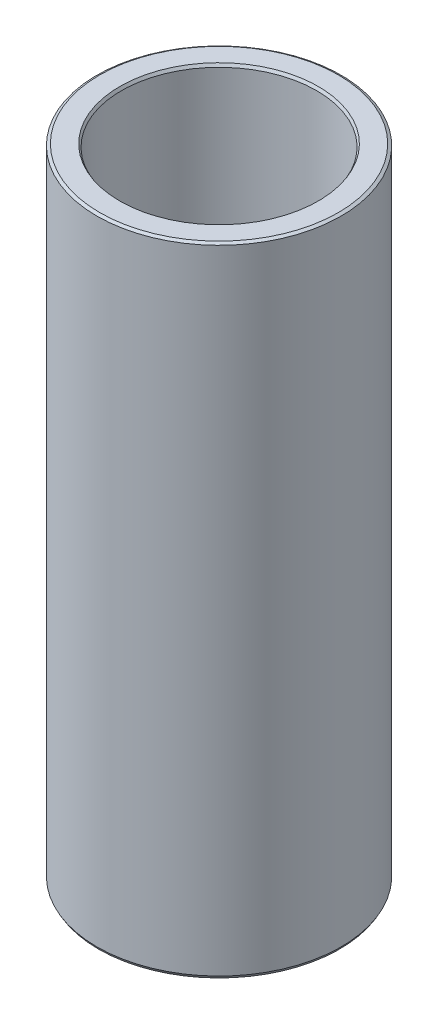
ISO-10303-21;
HEADER;
FILE_DESCRIPTION(('STEP AP214'),'2;1');
FILE_NAME('part.step','',(''),(''),'','','');
FILE_SCHEMA(('AUTOMOTIVE_DESIGN { 1 0 10303 214 1 1 1 1 }'));
ENDSEC;
DATA;
#1=APPLICATION_CONTEXT('core data for automotive mechanical design processes');
#2=APPLICATION_PROTOCOL_DEFINITION('international standard','automotive_design',2000,#1);
#3=PRODUCT_CONTEXT('',#1,'mechanical');
#4=PRODUCT('Part','Part','',(#3));
#5=PRODUCT_RELATED_PRODUCT_CATEGORY('part','',(#4));
#6=PRODUCT_DEFINITION_FORMATION('','',#4);
#7=PRODUCT_DEFINITION_CONTEXT('part definition',#1,'design');
#8=PRODUCT_DEFINITION('design','',#6,#7);
#9=PRODUCT_DEFINITION_SHAPE('','',#8);
#10=(LENGTH_UNIT() NAMED_UNIT(*) SI_UNIT(.MILLI.,.METRE.));
#11=(NAMED_UNIT(*) PLANE_ANGLE_UNIT() SI_UNIT($,.RADIAN.));
#12=(NAMED_UNIT(*) SI_UNIT($,.STERADIAN.) SOLID_ANGLE_UNIT());
#13=UNCERTAINTY_MEASURE_WITH_UNIT(LENGTH_MEASURE(1.E-05),#10,'distance_accuracy_value','');
#14=(GEOMETRIC_REPRESENTATION_CONTEXT(3) GLOBAL_UNCERTAINTY_ASSIGNED_CONTEXT((#13)) GLOBAL_UNIT_ASSIGNED_CONTEXT((#10,
#11,#12)) REPRESENTATION_CONTEXT('',''));
#15=CARTESIAN_POINT('',(0.,0.,0.));
#16=DIRECTION('',(0.,0.,1.));
#17=DIRECTION('',(1.,0.,0.));
#18=AXIS2_PLACEMENT_3D('',#15,#16,#17);
#19=CARTESIAN_POINT('',(0.,260.991136871071,0.));
#20=DIRECTION('',(0.,-1.,0.));
#21=DIRECTION('',(0.,0.,-1.));
#22=AXIS2_PLACEMENT_3D('',#19,#20,#21);
#23=CYLINDRICAL_SURFACE('',#22,50.);
#24=CARTESIAN_POINT('',(0.,1.15122841178061,0.));
#25=DIRECTION('',(0.,1.,0.));
#26=DIRECTION('',(0.,0.,1.));
#27=AXIS2_PLACEMENT_3D('',#24,#25,#26);
#28=CIRCLE('',#27,50.);
#29=CARTESIAN_POINT('',(0.,1.15122841178061,50.));
#30=VERTEX_POINT('',#29);
#31=EDGE_CURVE('E10',#30,#30,#28,.T.);
#32=ORIENTED_EDGE('',*,*,#31,.T.);
#33=EDGE_LOOP('',(#32));
#34=FACE_BOUND('',#33,.T.);
#35=CARTESIAN_POINT('',(0.,260.326474837631,0.));
#36=DIRECTION('',(0.,1.,0.));
#37=DIRECTION('',(0.,0.,1.));
#38=AXIS2_PLACEMENT_3D('',#35,#36,#37);
#39=CIRCLE('',#38,50.);
#40=CARTESIAN_POINT('',(0.,260.326474837631,50.));
#41=VERTEX_POINT('',#40);
#42=EDGE_CURVE('E50',#41,#41,#39,.F.);
#43=ORIENTED_EDGE('',*,*,#42,.T.);
#44=EDGE_LOOP('',(#43));
#45=FACE_BOUND('',#44,.T.);
#46=ADVANCED_FACE('F39',(#34,#45),#23,.T.);
#47=CARTESIAN_POINT('',(0.,260.991136871071,0.));
#48=DIRECTION('',(0.,1.,0.));
#49=DIRECTION('',(0.,0.,1.));
#50=AXIS2_PLACEMENT_3D('',#47,#48,#49);
#51=PLANE('',#50);
#52=CARTESIAN_POINT('',(0.,260.991136871071,0.));
#53=DIRECTION('',(0.,1.,0.));
#54=DIRECTION('',(0.,0.,1.));
#55=AXIS2_PLACEMENT_3D('',#52,#53,#54);
#56=CIRCLE('',#55,40.6477451683779);
#57=CARTESIAN_POINT('',(0.,260.991136871071,40.6477451683779));
#58=VERTEX_POINT('',#57);
#59=EDGE_CURVE('E58',#58,#58,#56,.F.);
#60=ORIENTED_EDGE('',*,*,#59,.T.);
#61=EDGE_LOOP('',(#60));
#62=FACE_BOUND('',#61,.T.);
#63=CARTESIAN_POINT('',(0.,260.991136871071,0.));
#64=DIRECTION('',(0.,1.,0.));
#65=DIRECTION('',(0.,0.,1.));
#66=AXIS2_PLACEMENT_3D('',#63,#64,#65);
#67=CIRCLE('',#66,48.8487715882194);
#68=CARTESIAN_POINT('',(0.,260.991136871071,48.8487715882194));
#69=VERTEX_POINT('',#68);
#70=EDGE_CURVE('E61',#69,#69,#67,.T.);
#71=ORIENTED_EDGE('',*,*,#70,.T.);
#72=EDGE_LOOP('',(#71));
#73=FACE_BOUND('',#72,.T.);
#74=ADVANCED_FACE('F88',(#62,#73),#51,.T.);
#75=CARTESIAN_POINT('',(0.,0.,0.));
#76=DIRECTION('',(0.,1.,0.));
#77=DIRECTION('',(0.,0.,1.));
#78=AXIS2_PLACEMENT_3D('',#75,#76,#77);
#79=PLANE('',#78);
#80=CARTESIAN_POINT('',(0.,0.,0.));
#81=DIRECTION('',(0.,1.,0.));
#82=DIRECTION('',(0.,0.,1.));
#83=AXIS2_PLACEMENT_3D('',#80,#81,#82);
#84=CIRCLE('',#83,41.1343115467182);
#85=CARTESIAN_POINT('',(0.,0.,-41.1343115467182));
#86=VERTEX_POINT('',#85);
#87=EDGE_CURVE('E51',#86,#86,#84,.T.);
#88=ORIENTED_EDGE('',*,*,#87,.T.);
#89=EDGE_LOOP('',(#88));
#90=FACE_BOUND('',#89,.T.);
#91=CARTESIAN_POINT('',(0.,0.,0.));
#92=DIRECTION('',(0.,1.,0.));
#93=DIRECTION('',(0.,0.,1.));
#94=AXIS2_PLACEMENT_3D('',#91,#92,#93);
#95=CIRCLE('',#94,49.3353379665597);
#96=CARTESIAN_POINT('',(0.,0.,49.3353379665597));
#97=VERTEX_POINT('',#96);
#98=EDGE_CURVE('E54',#97,#97,#95,.F.);
#99=ORIENTED_EDGE('',*,*,#98,.T.);
#100=EDGE_LOOP('',(#99));
#101=FACE_BOUND('',#100,.T.);
#102=ADVANCED_FACE('F83',(#90,#101),#79,.F.);
#103=CARTESIAN_POINT('',(0.,260.991136871071,0.));
#104=DIRECTION('',(0.,-1.,0.));
#105=DIRECTION('',(0.,0.,-1.));
#106=AXIS2_PLACEMENT_3D('',#103,#104,#105);
#107=CYLINDRICAL_SURFACE('',#106,39.9830831349376);
#108=CARTESIAN_POINT('',(0.,259.83990845929,0.));
#109=DIRECTION('',(0.,1.,0.));
#110=DIRECTION('',(0.,0.,1.));
#111=AXIS2_PLACEMENT_3D('',#108,#109,#110);
#112=CIRCLE('',#111,39.9830831349376);
#113=CARTESIAN_POINT('',(0.,259.83990845929,39.9830831349376));
#114=VERTEX_POINT('',#113);
#115=EDGE_CURVE('E67',#114,#114,#112,.T.);
#116=ORIENTED_EDGE('',*,*,#115,.T.);
#117=EDGE_LOOP('',(#116));
#118=FACE_BOUND('',#117,.T.);
#119=CARTESIAN_POINT('',(0.,0.664662033440289,0.));
#120=DIRECTION('',(0.,1.,0.));
#121=DIRECTION('',(0.,0.,1.));
#122=AXIS2_PLACEMENT_3D('',#119,#120,#121);
#123=CIRCLE('',#122,39.9830831349376);
#124=CARTESIAN_POINT('',(0.,0.664662033440289,-39.9830831349376));
#125=VERTEX_POINT('',#124);
#126=EDGE_CURVE('E69',#125,#125,#123,.F.);
#127=ORIENTED_EDGE('',*,*,#126,.T.);
#128=EDGE_LOOP('',(#127));
#129=FACE_BOUND('',#128,.T.);
#130=ADVANCED_FACE('F71',(#118,#129),#107,.F.);
#131=CARTESIAN_POINT('',(0.,259.83990845929,0.));
#132=DIRECTION('',(0.,1.,0.));
#133=DIRECTION('',(0.,0.,1.));
#134=AXIS2_PLACEMENT_3D('',#131,#132,#133);
#135=CONICAL_SURFACE('',#134,39.9830831349376,0.523598775598332);
#136=ORIENTED_EDGE('',*,*,#59,.F.);
#137=EDGE_LOOP('',(#136));
#138=FACE_BOUND('',#137,.T.);
#139=ORIENTED_EDGE('',*,*,#115,.F.);
#140=EDGE_LOOP('',(#139));
#141=FACE_BOUND('',#140,.T.);
#142=ADVANCED_FACE('F77',(#138,#141),#135,.F.);
#143=CARTESIAN_POINT('',(0.,0.,0.));
#144=DIRECTION('',(0.,-1.,0.));
#145=DIRECTION('',(0.,0.,-1.));
#146=AXIS2_PLACEMENT_3D('',#143,#144,#145);
#147=CONICAL_SURFACE('',#146,41.1343115467182,1.04719755119661);
#148=CARTESIAN_POINT('',(0.,0.664662033440289,-39.9830831349376));
#149=CARTESIAN_POINT('',(0.,0.657738470591954,-39.9950750975603));
#150=CARTESIAN_POINT('',(0.,0.650814907743617,-40.007067060183));
#151=CARTESIAN_POINT('',(0.,0.636967782046943,-40.0310509854284));
#152=CARTESIAN_POINT('',(0.,0.630044219198606,-40.0430429480511));
#153=CARTESIAN_POINT('',(0.,0.616197093501934,-40.0670268732966));
#154=CARTESIAN_POINT('',(0.,0.609273530653598,-40.0790188359193));
#155=CARTESIAN_POINT('',(0.,0.595426404956925,-40.1030027611647));
#156=CARTESIAN_POINT('',(0.,0.588502842108589,-40.1149947237874));
#157=CARTESIAN_POINT('',(0.,0.574655716411916,-40.1389786490329));
#158=CARTESIAN_POINT('',(0.,0.56773215356358,-40.1509706116556));
#159=CARTESIAN_POINT('',(0.,0.553885027866908,-40.174954536901));
#160=CARTESIAN_POINT('',(0.,0.54696146501857,-40.1869464995237));
#161=CARTESIAN_POINT('',(0.,0.533114339321897,-40.2109304247692));
#162=CARTESIAN_POINT('',(0.,0.526190776473561,-40.2229223873919));
#163=CARTESIAN_POINT('',(0.,0.512343650776889,-40.2469063126373));
#164=CARTESIAN_POINT('',(0.,0.505420087928553,-40.25889827526));
#165=CARTESIAN_POINT('',(0.,0.49157296223188,-40.2828822005055));
#166=CARTESIAN_POINT('',(0.,0.484649399383543,-40.2948741631282));
#167=CARTESIAN_POINT('',(0.,0.47080227368687,-40.3188580883736));
#168=CARTESIAN_POINT('',(0.,0.463878710838535,-40.3308500509963));
#169=CARTESIAN_POINT('',(0.,0.450031585141862,-40.3548339762417));
#170=CARTESIAN_POINT('',(0.,0.443108022293526,-40.3668259388645));
#171=CARTESIAN_POINT('',(0.,0.429260896596853,-40.3908098641099));
#172=CARTESIAN_POINT('',(0.,0.422337333748517,-40.4028018267326));
#173=CARTESIAN_POINT('',(0.,0.408490208051844,-40.426785751978));
#174=CARTESIAN_POINT('',(0.,0.401566645203507,-40.4387777146007));
#175=CARTESIAN_POINT('',(0.,0.387719519506834,-40.4627616398462));
#176=CARTESIAN_POINT('',(0.,0.380795956658498,-40.4747536024689));
#177=CARTESIAN_POINT('',(0.,0.366948830961826,-40.4987375277143));
#178=CARTESIAN_POINT('',(0.,0.36002526811349,-40.510729490337));
#179=CARTESIAN_POINT('',(0.,0.346178142416817,-40.5347134155825));
#180=CARTESIAN_POINT('',(0.,0.33925457956848,-40.5467053782052));
#181=CARTESIAN_POINT('',(0.,0.325407453871807,-40.5706893034506));
#182=CARTESIAN_POINT('',(0.,0.318483891023471,-40.5826812660733));
#183=CARTESIAN_POINT('',(0.,0.304636765326799,-40.6066651913188));
#184=CARTESIAN_POINT('',(0.,0.297713202478462,-40.6186571539415));
#185=CARTESIAN_POINT('',(0.,0.28386607678179,-40.6426410791869));
#186=CARTESIAN_POINT('',(0.,0.276942513933454,-40.6546330418096));
#187=CARTESIAN_POINT('',(0.,0.263095388236781,-40.6786169670551));
#188=CARTESIAN_POINT('',(0.,0.256171825388444,-40.6906089296778));
#189=CARTESIAN_POINT('',(0.,0.242324699691771,-40.7145928549232));
#190=CARTESIAN_POINT('',(0.,0.235401136843435,-40.7265848175459));
#191=CARTESIAN_POINT('',(0.,0.221554011146763,-40.7505687427913));
#192=CARTESIAN_POINT('',(0.,0.214630448298426,-40.7625607054141));
#193=CARTESIAN_POINT('',(0.,0.200783322601754,-40.7865446306595));
#194=CARTESIAN_POINT('',(0.,0.193859759753418,-40.7985365932822));
#195=CARTESIAN_POINT('',(0.,0.180012634056745,-40.8225205185276));
#196=CARTESIAN_POINT('',(0.,0.173089071208408,-40.8345124811504));
#197=CARTESIAN_POINT('',(0.,0.159241945511735,-40.8584964063958));
#198=CARTESIAN_POINT('',(0.,0.152318382663399,-40.8704883690185));
#199=CARTESIAN_POINT('',(0.,0.138471256966727,-40.8944722942639));
#200=CARTESIAN_POINT('',(0.,0.131547694118391,-40.9064642568867));
#201=CARTESIAN_POINT('',(0.,0.117700568421718,-40.9304481821321));
#202=CARTESIAN_POINT('',(0.,0.110777005573381,-40.9424401447548));
#203=CARTESIAN_POINT('',(0.,0.0969298798767081,-40.9664240700002));
#204=CARTESIAN_POINT('',(0.,0.0900063170283723,-40.9784160326229));
#205=CARTESIAN_POINT('',(0.,0.0761591913316998,-41.0023999578684));
#206=CARTESIAN_POINT('',(0.,0.0692356284833633,-41.0143919204911));
#207=CARTESIAN_POINT('',(0.,0.0553885027866908,-41.0383758457365));
#208=CARTESIAN_POINT('',(0.,0.0484649399383549,-41.0503678083592));
#209=CARTESIAN_POINT('',(0.,0.0346178142416822,-41.0743517336047));
#210=CARTESIAN_POINT('',(0.,0.0276942513933453,-41.0863436962274));
#211=CARTESIAN_POINT('',(0.,0.0138471256966717,-41.1103276214728));
#212=CARTESIAN_POINT('',(0.,0.00692356284833486,-41.1223195840955));
#213=CARTESIAN_POINT('',(0.,0.,-41.1343115467182));
#214=B_SPLINE_CURVE_WITH_KNOTS('',3,(#148,#149,#150,#151,#152,#153,#154,#155,#156,#157,#158,
#159,#160,#161,#162,#163,#164,#165,#166,#167,#168,#169,#170,#171,#172,#173,#174,#175,#176,#177,
#178,#179,#180,#181,#182,#183,#184,#185,#186,#187,#188,#189,#190,#191,#192,#193,#194,#195,#196,
#197,#198,#199,#200,#201,#202,#203,#204,#205,#206,#207,#208,#209,#210,#211,#212,#213),
.UNSPECIFIED.,.F.,.F.,(4,2,2,2,2,2,2,2,2,2,2,2,2,2,2,2,2,2,2,2,2,2,2,2,2,2,2,2,2,2,2,2,4),(0.,
0.0415413770900208,0.0830827541800355,0.124624131270056,0.166165508360077,0.207706885450098,
0.249248262540113,0.290789639630133,0.332331016720154,0.373872393810169,0.41541377090019,
0.45695514799021,0.498496525080231,0.540037902170246,0.581579279260267,0.623120656350287,
0.664662033440302,0.706203410530323,0.747744787620344,0.789286164710364,0.830827541800379,
0.8723689188904,0.913910295980421,0.955451673070441,0.996993050160456,1.03853442725048,
1.0800758043405,1.12161718143051,1.16315855852053,1.20469993561055,1.24624131270058,
1.28778268979059,1.32932406688061),.UNSPECIFIED.);
#215=EDGE_CURVE('BSEAM73',#125,#86,#214,.T.);
#216=ORIENTED_EDGE('',*,*,#126,.F.);
#217=ORIENTED_EDGE('',*,*,#87,.F.);
#218=ORIENTED_EDGE('',*,*,#215,.T.);
#219=ORIENTED_EDGE('',*,*,#215,.F.);
#220=EDGE_LOOP('',(#216,#218,#217,#219));
#221=FACE_BOUND('',#220,.T.);
#222=ADVANCED_FACE('F73',(#221),#147,.F.);
#223=CARTESIAN_POINT('',(0.,1.15122841178061,0.));
#224=DIRECTION('',(0.,1.,0.));
#225=DIRECTION('',(0.,0.,1.));
#226=AXIS2_PLACEMENT_3D('',#223,#224,#225);
#227=CONICAL_SURFACE('',#226,50.,0.523598775598321);
#228=ORIENTED_EDGE('',*,*,#98,.F.);
#229=EDGE_LOOP('',(#228));
#230=FACE_BOUND('',#229,.T.);
#231=ORIENTED_EDGE('',*,*,#31,.F.);
#232=EDGE_LOOP('',(#231));
#233=FACE_BOUND('',#232,.T.);
#234=ADVANCED_FACE('F76',(#230,#233),#227,.T.);
#235=CARTESIAN_POINT('',(0.,260.991136871071,0.));
#236=DIRECTION('',(0.,-1.,0.));
#237=DIRECTION('',(0.,0.,-1.));
#238=AXIS2_PLACEMENT_3D('',#235,#236,#237);
#239=CONICAL_SURFACE('',#238,48.8487715882194,1.04719755119656);
#240=ORIENTED_EDGE('',*,*,#42,.F.);
#241=EDGE_LOOP('',(#240));
#242=FACE_BOUND('',#241,.T.);
#243=ORIENTED_EDGE('',*,*,#70,.F.);
#244=EDGE_LOOP('',(#243));
#245=FACE_BOUND('',#244,.T.);
#246=ADVANCED_FACE('F45',(#242,#245),#239,.T.);
#247=CLOSED_SHELL('',(#46,#74,#102,#130,#142,#222,#234,#246));
#248=MANIFOLD_SOLID_BREP('B2',#247);
#249=ADVANCED_BREP_SHAPE_REPRESENTATION('',(#18,#248),#14);
#250=SHAPE_DEFINITION_REPRESENTATION(#9,#249);
ENDSEC;
END-ISO-10303-21;
